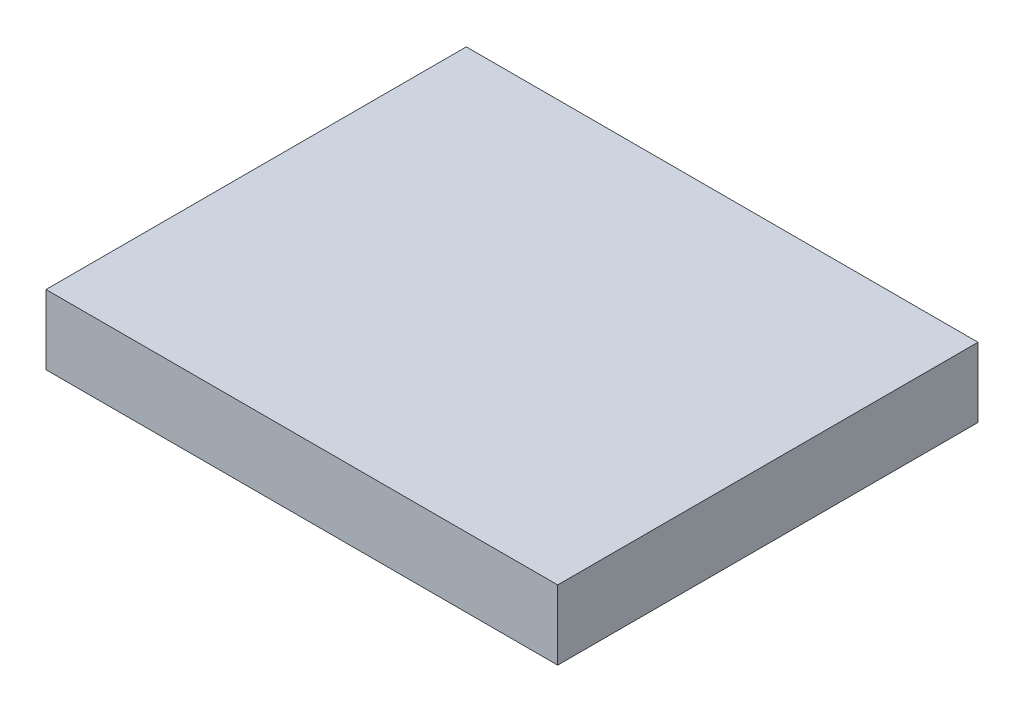
ISO-10303-21;
HEADER;
FILE_DESCRIPTION(('STEP AP214'),'2;1');
FILE_NAME('part.step','',(''),(''),'','','');
FILE_SCHEMA(('AUTOMOTIVE_DESIGN { 1 0 10303 214 1 1 1 1 }'));
ENDSEC;
DATA;
#1=APPLICATION_CONTEXT('core data for automotive mechanical design processes');
#2=APPLICATION_PROTOCOL_DEFINITION('international standard','automotive_design',2000,#1);
#3=PRODUCT_CONTEXT('',#1,'mechanical');
#4=PRODUCT('Part','Part','',(#3));
#5=PRODUCT_RELATED_PRODUCT_CATEGORY('part','',(#4));
#6=PRODUCT_DEFINITION_FORMATION('','',#4);
#7=PRODUCT_DEFINITION_CONTEXT('part definition',#1,'design');
#8=PRODUCT_DEFINITION('design','',#6,#7);
#9=PRODUCT_DEFINITION_SHAPE('','',#8);
#10=(LENGTH_UNIT() NAMED_UNIT(*) SI_UNIT(.MILLI.,.METRE.));
#11=(NAMED_UNIT(*) PLANE_ANGLE_UNIT() SI_UNIT($,.RADIAN.));
#12=(NAMED_UNIT(*) SI_UNIT($,.STERADIAN.) SOLID_ANGLE_UNIT());
#13=UNCERTAINTY_MEASURE_WITH_UNIT(LENGTH_MEASURE(1.E-05),#10,'distance_accuracy_value','');
#14=(GEOMETRIC_REPRESENTATION_CONTEXT(3) GLOBAL_UNCERTAINTY_ASSIGNED_CONTEXT((#13)) GLOBAL_UNIT_ASSIGNED_CONTEXT((#10,
#11,#12)) REPRESENTATION_CONTEXT('',''));
#15=CARTESIAN_POINT('',(0.,0.,0.));
#16=DIRECTION('',(0.,0.,1.));
#17=DIRECTION('',(1.,0.,0.));
#18=AXIS2_PLACEMENT_3D('',#15,#16,#17);
#19=CARTESIAN_POINT('',(-17.068246246518,4.83,3.02592365239856));
#20=DIRECTION('',(1.,0.,0.));
#21=DIRECTION('',(0.,0.,-1.));
#22=AXIS2_PLACEMENT_3D('',#19,#20,#21);
#23=PLANE('',#22);
#24=DIRECTION('',(0.,0.,1.));
#25=VECTOR('',#24,1.);
#26=CARTESIAN_POINT('',(-17.068246246518,0.,3.02592365239856));
#27=LINE('',#26,#25);
#28=CARTESIAN_POINT('',(-17.068246246518,0.,3.02592365239856));
#29=VERTEX_POINT('',#28);
#30=CARTESIAN_POINT('',(-17.068246246518,0.,32.2359236523986));
#31=VERTEX_POINT('',#30);
#32=EDGE_CURVE('E113',#29,#31,#27,.T.);
#33=ORIENTED_EDGE('',*,*,#32,.T.);
#34=DIRECTION('',(0.,-1.,0.));
#35=VECTOR('',#34,1.);
#36=CARTESIAN_POINT('',(-17.068246246518,4.83,32.2359236523986));
#37=LINE('',#36,#35);
#38=CARTESIAN_POINT('',(-17.068246246518,4.83,32.2359236523986));
#39=VERTEX_POINT('',#38);
#40=EDGE_CURVE('E11',#39,#31,#37,.T.);
#41=ORIENTED_EDGE('',*,*,#40,.F.);
#42=DIRECTION('',(0.,0.,1.));
#43=VECTOR('',#42,1.);
#44=CARTESIAN_POINT('',(-17.068246246518,4.83,3.02592365239856));
#45=LINE('',#44,#43);
#46=CARTESIAN_POINT('',(-17.068246246518,4.83,3.02592365239856));
#47=VERTEX_POINT('',#46);
#48=EDGE_CURVE('E97',#47,#39,#45,.T.);
#49=ORIENTED_EDGE('',*,*,#48,.F.);
#50=DIRECTION('',(0.,-1.,0.));
#51=VECTOR('',#50,1.);
#52=CARTESIAN_POINT('',(-17.068246246518,4.83,3.02592365239856));
#53=LINE('',#52,#51);
#54=EDGE_CURVE('E109',#47,#29,#53,.T.);
#55=ORIENTED_EDGE('',*,*,#54,.T.);
#56=EDGE_LOOP('',(#33,#41,#49,#55));
#57=FACE_BOUND('',#56,.T.);
#58=ADVANCED_FACE('F45',(#57),#23,.F.);
#59=CARTESIAN_POINT('',(-17.068246246518,4.83,32.2359236523986));
#60=DIRECTION('',(0.,0.,-1.));
#61=DIRECTION('',(-1.,0.,0.));
#62=AXIS2_PLACEMENT_3D('',#59,#60,#61);
#63=PLANE('',#62);
#64=DIRECTION('',(1.,0.,0.));
#65=VECTOR('',#64,1.);
#66=CARTESIAN_POINT('',(-17.068246246518,0.,32.2359236523986));
#67=LINE('',#66,#65);
#68=CARTESIAN_POINT('',(18.491753753482,0.,32.2359236523986));
#69=VERTEX_POINT('',#68);
#70=EDGE_CURVE('E102',#31,#69,#67,.T.);
#71=ORIENTED_EDGE('',*,*,#70,.T.);
#72=DIRECTION('',(0.,-1.,0.));
#73=VECTOR('',#72,1.);
#74=CARTESIAN_POINT('',(18.491753753482,4.83,32.2359236523986));
#75=LINE('',#74,#73);
#76=CARTESIAN_POINT('',(18.491753753482,4.83,32.2359236523986));
#77=VERTEX_POINT('',#76);
#78=EDGE_CURVE('E54',#77,#69,#75,.T.);
#79=ORIENTED_EDGE('',*,*,#78,.F.);
#80=DIRECTION('',(1.,0.,0.));
#81=VECTOR('',#80,1.);
#82=CARTESIAN_POINT('',(-17.068246246518,4.83,32.2359236523986));
#83=LINE('',#82,#81);
#84=EDGE_CURVE('E92',#39,#77,#83,.T.);
#85=ORIENTED_EDGE('',*,*,#84,.F.);
#86=ORIENTED_EDGE('',*,*,#40,.T.);
#87=EDGE_LOOP('',(#71,#79,#85,#86));
#88=FACE_BOUND('',#87,.T.);
#89=ADVANCED_FACE('F101',(#88),#63,.F.);
#90=CARTESIAN_POINT('',(18.491753753482,4.83,3.02592365239856));
#91=DIRECTION('',(-1.,0.,0.));
#92=DIRECTION('',(0.,0.,1.));
#93=AXIS2_PLACEMENT_3D('',#90,#91,#92);
#94=PLANE('',#93);
#95=DIRECTION('',(0.,0.,-1.));
#96=VECTOR('',#95,1.);
#97=CARTESIAN_POINT('',(18.491753753482,0.,3.02592365239856));
#98=LINE('',#97,#96);
#99=CARTESIAN_POINT('',(18.491753753482,0.,3.02592365239856));
#100=VERTEX_POINT('',#99);
#101=EDGE_CURVE('E79',#69,#100,#98,.T.);
#102=ORIENTED_EDGE('',*,*,#101,.T.);
#103=DIRECTION('',(0.,-1.,0.));
#104=VECTOR('',#103,1.);
#105=CARTESIAN_POINT('',(18.491753753482,4.83,3.02592365239856));
#106=LINE('',#105,#104);
#107=CARTESIAN_POINT('',(18.491753753482,4.83,3.02592365239856));
#108=VERTEX_POINT('',#107);
#109=EDGE_CURVE('E104',#108,#100,#106,.T.);
#110=ORIENTED_EDGE('',*,*,#109,.F.);
#111=DIRECTION('',(0.,0.,-1.));
#112=VECTOR('',#111,1.);
#113=CARTESIAN_POINT('',(18.491753753482,4.83,3.02592365239856));
#114=LINE('',#113,#112);
#115=EDGE_CURVE('E95',#77,#108,#114,.T.);
#116=ORIENTED_EDGE('',*,*,#115,.F.);
#117=ORIENTED_EDGE('',*,*,#78,.T.);
#118=EDGE_LOOP('',(#102,#110,#116,#117));
#119=FACE_BOUND('',#118,.T.);
#120=ADVANCED_FACE('F105',(#119),#94,.F.);
#121=CARTESIAN_POINT('',(-17.068246246518,4.83,3.02592365239856));
#122=DIRECTION('',(0.,0.,1.));
#123=DIRECTION('',(1.,0.,0.));
#124=AXIS2_PLACEMENT_3D('',#121,#122,#123);
#125=PLANE('',#124);
#126=DIRECTION('',(-1.,0.,0.));
#127=VECTOR('',#126,1.);
#128=CARTESIAN_POINT('',(-17.068246246518,0.,3.02592365239856));
#129=LINE('',#128,#127);
#130=EDGE_CURVE('E85',#100,#29,#129,.T.);
#131=ORIENTED_EDGE('',*,*,#130,.T.);
#132=ORIENTED_EDGE('',*,*,#54,.F.);
#133=DIRECTION('',(-1.,0.,0.));
#134=VECTOR('',#133,1.);
#135=CARTESIAN_POINT('',(-17.068246246518,4.83,3.02592365239856));
#136=LINE('',#135,#134);
#137=EDGE_CURVE('E62',#108,#47,#136,.T.);
#138=ORIENTED_EDGE('',*,*,#137,.F.);
#139=ORIENTED_EDGE('',*,*,#109,.T.);
#140=EDGE_LOOP('',(#131,#132,#138,#139));
#141=FACE_BOUND('',#140,.T.);
#142=ADVANCED_FACE('F126',(#141),#125,.F.);
#143=CARTESIAN_POINT('',(0.,4.83,0.));
#144=DIRECTION('',(0.,1.,0.));
#145=DIRECTION('',(0.,0.,1.));
#146=AXIS2_PLACEMENT_3D('',#143,#144,#145);
#147=PLANE('',#146);
#148=ORIENTED_EDGE('',*,*,#48,.T.);
#149=ORIENTED_EDGE('',*,*,#84,.T.);
#150=ORIENTED_EDGE('',*,*,#115,.T.);
#151=ORIENTED_EDGE('',*,*,#137,.T.);
#152=EDGE_LOOP('',(#148,#149,#150,#151));
#153=FACE_BOUND('',#152,.T.);
#154=ADVANCED_FACE('F93',(#153),#147,.T.);
#155=CARTESIAN_POINT('',(0.,0.,0.));
#156=DIRECTION('',(0.,1.,0.));
#157=DIRECTION('',(0.,0.,1.));
#158=AXIS2_PLACEMENT_3D('',#155,#156,#157);
#159=PLANE('',#158);
#160=ORIENTED_EDGE('',*,*,#32,.F.);
#161=ORIENTED_EDGE('',*,*,#130,.F.);
#162=ORIENTED_EDGE('',*,*,#101,.F.);
#163=ORIENTED_EDGE('',*,*,#70,.F.);
#164=EDGE_LOOP('',(#160,#161,#162,#163));
#165=FACE_BOUND('',#164,.T.);
#166=ADVANCED_FACE('F129',(#165),#159,.F.);
#167=CLOSED_SHELL('',(#58,#89,#120,#142,#154,#166));
#168=MANIFOLD_SOLID_BREP('B2',#167);
#169=ADVANCED_BREP_SHAPE_REPRESENTATION('',(#18,#168),#14);
#170=SHAPE_DEFINITION_REPRESENTATION(#9,#169);
ENDSEC;
END-ISO-10303-21;
